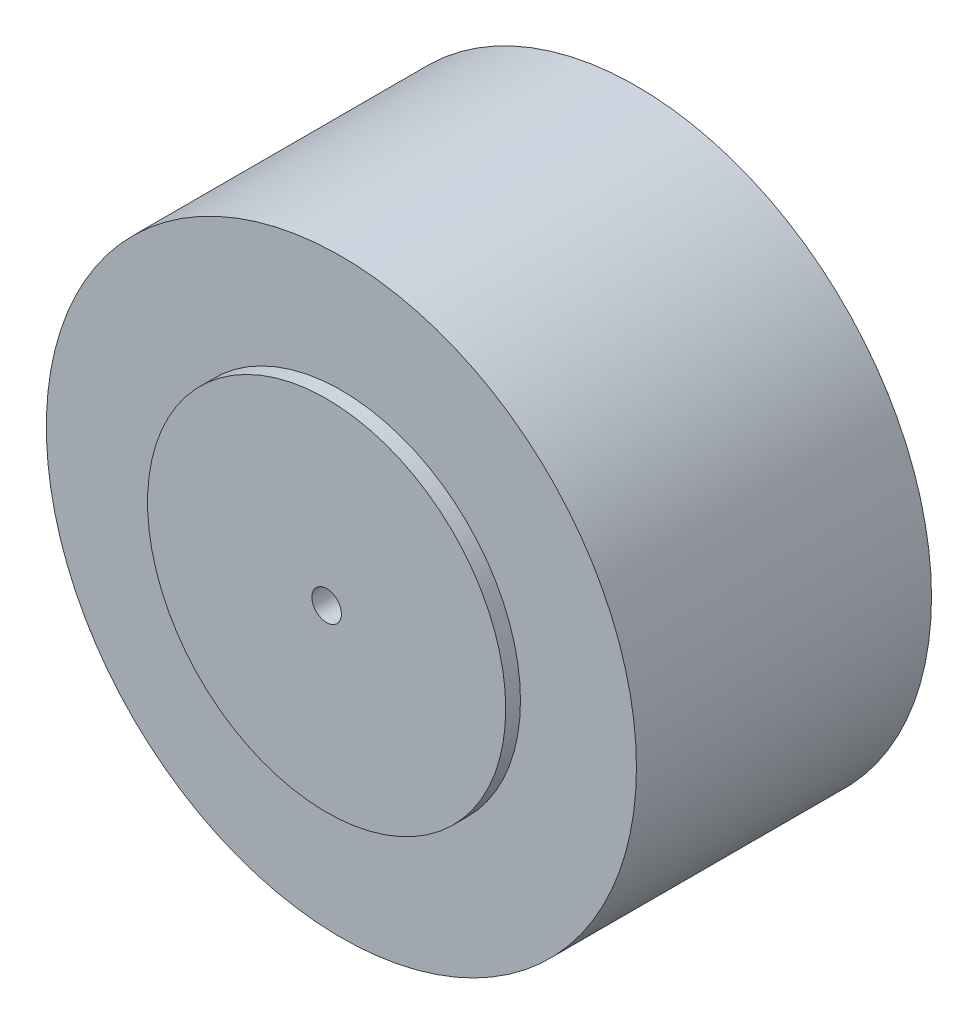
ISO-10303-21;
HEADER;
FILE_DESCRIPTION(('STEP AP214'),'2;1');
FILE_NAME('part.step','',(''),(''),'','','');
FILE_SCHEMA(('AUTOMOTIVE_DESIGN { 1 0 10303 214 1 1 1 1 }'));
ENDSEC;
DATA;
#1=APPLICATION_CONTEXT('core data for automotive mechanical design processes');
#2=APPLICATION_PROTOCOL_DEFINITION('international standard','automotive_design',2000,#1);
#3=PRODUCT_CONTEXT('',#1,'mechanical');
#4=PRODUCT('Part','Part','',(#3));
#5=PRODUCT_RELATED_PRODUCT_CATEGORY('part','',(#4));
#6=PRODUCT_DEFINITION_FORMATION('','',#4);
#7=PRODUCT_DEFINITION_CONTEXT('part definition',#1,'design');
#8=PRODUCT_DEFINITION('design','',#6,#7);
#9=PRODUCT_DEFINITION_SHAPE('','',#8);
#10=(LENGTH_UNIT() NAMED_UNIT(*) SI_UNIT(.MILLI.,.METRE.));
#11=(NAMED_UNIT(*) PLANE_ANGLE_UNIT() SI_UNIT($,.RADIAN.));
#12=(NAMED_UNIT(*) SI_UNIT($,.STERADIAN.) SOLID_ANGLE_UNIT());
#13=UNCERTAINTY_MEASURE_WITH_UNIT(LENGTH_MEASURE(1.E-05),#10,'distance_accuracy_value','');
#14=(GEOMETRIC_REPRESENTATION_CONTEXT(3) GLOBAL_UNCERTAINTY_ASSIGNED_CONTEXT((#13)) GLOBAL_UNIT_ASSIGNED_CONTEXT((#10,
#11,#12)) REPRESENTATION_CONTEXT('',''));
#15=CARTESIAN_POINT('',(0.,0.,0.));
#16=DIRECTION('',(0.,0.,1.));
#17=DIRECTION('',(1.,0.,0.));
#18=AXIS2_PLACEMENT_3D('',#15,#16,#17);
#19=CARTESIAN_POINT('',(0.,0.,12.7));
#20=DIRECTION('',(0.,0.,-1.));
#21=DIRECTION('',(-1.,0.,0.));
#22=AXIS2_PLACEMENT_3D('',#19,#20,#21);
#23=CYLINDRICAL_SURFACE('',#22,12.7);
#24=CARTESIAN_POINT('',(0.,0.,12.7));
#25=DIRECTION('',(0.,0.,1.));
#26=DIRECTION('',(1.,0.,0.));
#27=AXIS2_PLACEMENT_3D('',#24,#25,#26);
#28=CIRCLE('',#27,12.7);
#29=CARTESIAN_POINT('',(12.7,0.,12.7));
#30=VERTEX_POINT('',#29);
#31=EDGE_CURVE('E43',#30,#30,#28,.T.);
#32=ORIENTED_EDGE('',*,*,#31,.F.);
#33=EDGE_LOOP('',(#32));
#34=FACE_BOUND('',#33,.T.);
#35=CARTESIAN_POINT('',(0.,0.,0.));
#36=DIRECTION('',(0.,0.,1.));
#37=DIRECTION('',(1.,0.,0.));
#38=AXIS2_PLACEMENT_3D('',#35,#36,#37);
#39=CIRCLE('',#38,12.7);
#40=CARTESIAN_POINT('',(12.7,0.,0.));
#41=VERTEX_POINT('',#40);
#42=EDGE_CURVE('E34',#41,#41,#39,.T.);
#43=ORIENTED_EDGE('',*,*,#42,.T.);
#44=EDGE_LOOP('',(#43));
#45=FACE_BOUND('',#44,.T.);
#46=ADVANCED_FACE('F31',(#34,#45),#23,.T.);
#47=CARTESIAN_POINT('',(0.,0.,12.7));
#48=DIRECTION('',(0.,0.,1.));
#49=DIRECTION('',(1.,0.,0.));
#50=AXIS2_PLACEMENT_3D('',#47,#48,#49);
#51=PLANE('',#50);
#52=CARTESIAN_POINT('',(0.,0.,12.7));
#53=DIRECTION('',(0.,0.,1.));
#54=DIRECTION('',(1.,0.,0.));
#55=AXIS2_PLACEMENT_3D('',#52,#53,#54);
#56=CIRCLE('',#55,7.70834564981772);
#57=CARTESIAN_POINT('',(7.70834564981772,0.,12.7));
#58=VERTEX_POINT('',#57);
#59=EDGE_CURVE('E38',#58,#58,#56,.T.);
#60=ORIENTED_EDGE('',*,*,#59,.F.);
#61=EDGE_LOOP('',(#60));
#62=FACE_BOUND('',#61,.T.);
#63=ORIENTED_EDGE('',*,*,#31,.T.);
#64=EDGE_LOOP('',(#63));
#65=FACE_BOUND('',#64,.T.);
#66=ADVANCED_FACE('F61',(#62,#65),#51,.T.);
#67=CARTESIAN_POINT('',(0.,0.,0.));
#68=DIRECTION('',(0.,0.,1.));
#69=DIRECTION('',(1.,0.,0.));
#70=AXIS2_PLACEMENT_3D('',#67,#68,#69);
#71=PLANE('',#70);
#72=CARTESIAN_POINT('',(0.,0.,0.));
#73=DIRECTION('',(0.,0.,-1.));
#74=DIRECTION('',(-1.,0.,0.));
#75=AXIS2_PLACEMENT_3D('',#72,#73,#74);
#76=CIRCLE('',#75,7.67798120902183);
#77=CARTESIAN_POINT('',(-7.67798120902183,0.,0.));
#78=VERTEX_POINT('',#77);
#79=EDGE_CURVE('E10',#78,#78,#76,.T.);
#80=ORIENTED_EDGE('',*,*,#79,.F.);
#81=EDGE_LOOP('',(#80));
#82=FACE_BOUND('',#81,.T.);
#83=ORIENTED_EDGE('',*,*,#42,.F.);
#84=EDGE_LOOP('',(#83));
#85=FACE_BOUND('',#84,.T.);
#86=ADVANCED_FACE('F58',(#82,#85),#71,.F.);
#87=CARTESIAN_POINT('',(0.,0.,13.335));
#88=DIRECTION('',(0.,0.,-1.));
#89=DIRECTION('',(-1.,0.,0.));
#90=AXIS2_PLACEMENT_3D('',#87,#88,#89);
#91=CYLINDRICAL_SURFACE('',#90,7.70834564981772);
#92=CARTESIAN_POINT('',(0.,0.,13.335));
#93=DIRECTION('',(0.,0.,1.));
#94=DIRECTION('',(1.,0.,0.));
#95=AXIS2_PLACEMENT_3D('',#92,#93,#94);
#96=CIRCLE('',#95,7.70834564981772);
#97=CARTESIAN_POINT('',(7.70834564981772,0.,13.335));
#98=VERTEX_POINT('',#97);
#99=EDGE_CURVE('E49',#98,#98,#96,.T.);
#100=ORIENTED_EDGE('',*,*,#99,.F.);
#101=EDGE_LOOP('',(#100));
#102=FACE_BOUND('',#101,.T.);
#103=ORIENTED_EDGE('',*,*,#59,.T.);
#104=EDGE_LOOP('',(#103));
#105=FACE_BOUND('',#104,.T.);
#106=ADVANCED_FACE('F60',(#102,#105),#91,.T.);
#107=CARTESIAN_POINT('',(0.,0.,13.335));
#108=DIRECTION('',(0.,0.,1.));
#109=DIRECTION('',(1.,0.,0.));
#110=AXIS2_PLACEMENT_3D('',#107,#108,#109);
#111=PLANE('',#110);
#112=CARTESIAN_POINT('',(0.,0.,13.335));
#113=DIRECTION('',(0.,0.,1.));
#114=DIRECTION('',(1.,0.,0.));
#115=AXIS2_PLACEMENT_3D('',#112,#113,#114);
#116=CIRCLE('',#115,0.635);
#117=CARTESIAN_POINT('',(0.635,0.,13.335));
#118=VERTEX_POINT('',#117);
#119=EDGE_CURVE('E162',#118,#118,#116,.T.);
#120=ORIENTED_EDGE('',*,*,#119,.F.);
#121=EDGE_LOOP('',(#120));
#122=FACE_BOUND('',#121,.T.);
#123=ORIENTED_EDGE('',*,*,#99,.T.);
#124=EDGE_LOOP('',(#123));
#125=FACE_BOUND('',#124,.T.);
#126=ADVANCED_FACE('F67',(#122,#125),#111,.T.);
#127=CARTESIAN_POINT('',(0.,0.,-0.635));
#128=DIRECTION('',(0.,0.,1.));
#129=DIRECTION('',(1.,0.,0.));
#130=AXIS2_PLACEMENT_3D('',#127,#128,#129);
#131=CYLINDRICAL_SURFACE('',#130,7.67798120902183);
#132=CARTESIAN_POINT('',(0.,0.,-0.635));
#133=DIRECTION('',(0.,0.,-1.));
#134=DIRECTION('',(-1.,0.,0.));
#135=AXIS2_PLACEMENT_3D('',#132,#133,#134);
#136=CIRCLE('',#135,7.67798120902183);
#137=CARTESIAN_POINT('',(-7.67798120902183,0.,-0.635));
#138=VERTEX_POINT('',#137);
#139=EDGE_CURVE('E47',#138,#138,#136,.T.);
#140=ORIENTED_EDGE('',*,*,#139,.F.);
#141=EDGE_LOOP('',(#140));
#142=FACE_BOUND('',#141,.T.);
#143=ORIENTED_EDGE('',*,*,#79,.T.);
#144=EDGE_LOOP('',(#143));
#145=FACE_BOUND('',#144,.T.);
#146=ADVANCED_FACE('F97',(#142,#145),#131,.T.);
#147=CARTESIAN_POINT('',(0.,0.,-0.635));
#148=DIRECTION('',(0.,0.,-1.));
#149=DIRECTION('',(-1.,0.,0.));
#150=AXIS2_PLACEMENT_3D('',#147,#148,#149);
#151=PLANE('',#150);
#152=CARTESIAN_POINT('',(0.,0.,-0.635));
#153=DIRECTION('',(0.,0.,-1.));
#154=DIRECTION('',(-1.,0.,0.));
#155=AXIS2_PLACEMENT_3D('',#152,#153,#154);
#156=CIRCLE('',#155,0.635);
#157=CARTESIAN_POINT('',(-0.635,0.,-0.635));
#158=VERTEX_POINT('',#157);
#159=EDGE_CURVE('E163',#158,#158,#156,.T.);
#160=ORIENTED_EDGE('',*,*,#159,.F.);
#161=EDGE_LOOP('',(#160));
#162=FACE_BOUND('',#161,.T.);
#163=ORIENTED_EDGE('',*,*,#139,.T.);
#164=EDGE_LOOP('',(#163));
#165=FACE_BOUND('',#164,.T.);
#166=ADVANCED_FACE('F102',(#162,#165),#151,.T.);
#167=CARTESIAN_POINT('',(0.,0.,12.065));
#168=DIRECTION('',(0.,0.,1.));
#169=DIRECTION('',(1.,0.,0.));
#170=AXIS2_PLACEMENT_3D('',#167,#168,#169);
#171=CYLINDRICAL_SURFACE('',#170,0.635);
#172=CARTESIAN_POINT('',(0.,0.,12.065));
#173=DIRECTION('',(0.,0.,1.));
#174=DIRECTION('',(1.,0.,0.));
#175=AXIS2_PLACEMENT_3D('',#172,#173,#174);
#176=CIRCLE('',#175,0.635);
#177=CARTESIAN_POINT('',(0.635,0.,12.065));
#178=VERTEX_POINT('',#177);
#179=EDGE_CURVE('E166',#178,#178,#176,.T.);
#180=ORIENTED_EDGE('',*,*,#179,.F.);
#181=EDGE_LOOP('',(#180));
#182=FACE_BOUND('',#181,.T.);
#183=ORIENTED_EDGE('',*,*,#119,.T.);
#184=EDGE_LOOP('',(#183));
#185=FACE_BOUND('',#184,.T.);
#186=ADVANCED_FACE('F115',(#182,#185),#171,.F.);
#187=CARTESIAN_POINT('',(0.,0.,12.065));
#188=DIRECTION('',(0.,0.,1.));
#189=DIRECTION('',(1.,0.,0.));
#190=AXIS2_PLACEMENT_3D('',#187,#188,#189);
#191=PLANE('',#190);
#192=ORIENTED_EDGE('',*,*,#179,.T.);
#193=EDGE_LOOP('',(#192));
#194=FACE_BOUND('',#193,.T.);
#195=ADVANCED_FACE('F120',(#194),#191,.T.);
#196=CARTESIAN_POINT('',(0.,0.,0.635));
#197=DIRECTION('',(0.,0.,-1.));
#198=DIRECTION('',(-1.,0.,0.));
#199=AXIS2_PLACEMENT_3D('',#196,#197,#198);
#200=CYLINDRICAL_SURFACE('',#199,0.635);
#201=CARTESIAN_POINT('',(0.,0.,0.635));
#202=DIRECTION('',(0.,0.,-1.));
#203=DIRECTION('',(-1.,0.,0.));
#204=AXIS2_PLACEMENT_3D('',#201,#202,#203);
#205=CIRCLE('',#204,0.635);
#206=CARTESIAN_POINT('',(-0.635,0.,0.635));
#207=VERTEX_POINT('',#206);
#208=EDGE_CURVE('E161',#207,#207,#205,.T.);
#209=ORIENTED_EDGE('',*,*,#208,.F.);
#210=EDGE_LOOP('',(#209));
#211=FACE_BOUND('',#210,.T.);
#212=ORIENTED_EDGE('',*,*,#159,.T.);
#213=EDGE_LOOP('',(#212));
#214=FACE_BOUND('',#213,.T.);
#215=ADVANCED_FACE('F130',(#211,#214),#200,.F.);
#216=CARTESIAN_POINT('',(0.,0.,0.635));
#217=DIRECTION('',(0.,0.,-1.));
#218=DIRECTION('',(-1.,0.,0.));
#219=AXIS2_PLACEMENT_3D('',#216,#217,#218);
#220=PLANE('',#219);
#221=ORIENTED_EDGE('',*,*,#208,.T.);
#222=EDGE_LOOP('',(#221));
#223=FACE_BOUND('',#222,.T.);
#224=ADVANCED_FACE('F145',(#223),#220,.T.);
#225=CLOSED_SHELL('',(#46,#66,#86,#106,#126,#146,#166,#186,#195,#215,#224));
#226=MANIFOLD_SOLID_BREP('B2',#225);
#227=ADVANCED_BREP_SHAPE_REPRESENTATION('',(#18,#226),#14);
#228=SHAPE_DEFINITION_REPRESENTATION(#9,#227);
ENDSEC;
END-ISO-10303-21;
